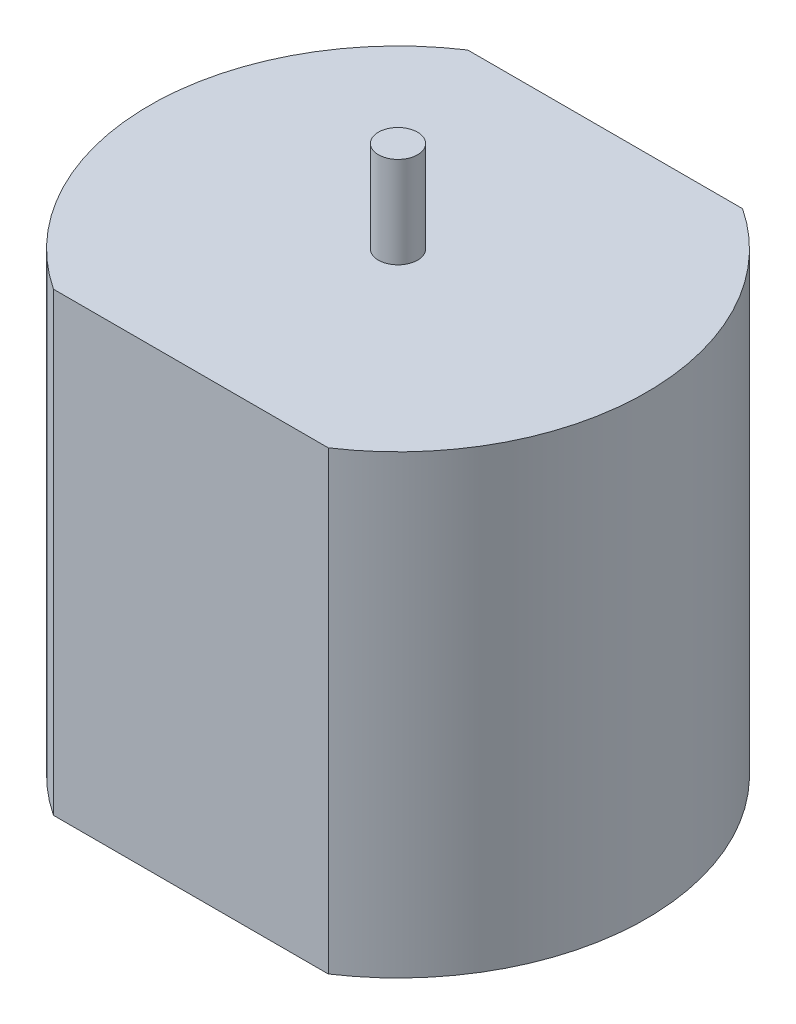
ISO-10303-21;
HEADER;
FILE_DESCRIPTION(('STEP AP214'),'2;1');
FILE_NAME('part.step','',(''),(''),'','','');
FILE_SCHEMA(('AUTOMOTIVE_DESIGN { 1 0 10303 214 1 1 1 1 }'));
ENDSEC;
DATA;
#1=APPLICATION_CONTEXT('core data for automotive mechanical design processes');
#2=APPLICATION_PROTOCOL_DEFINITION('international standard','automotive_design',2000,#1);
#3=PRODUCT_CONTEXT('',#1,'mechanical');
#4=PRODUCT('Part','Part','',(#3));
#5=PRODUCT_RELATED_PRODUCT_CATEGORY('part','',(#4));
#6=PRODUCT_DEFINITION_FORMATION('','',#4);
#7=PRODUCT_DEFINITION_CONTEXT('part definition',#1,'design');
#8=PRODUCT_DEFINITION('design','',#6,#7);
#9=PRODUCT_DEFINITION_SHAPE('','',#8);
#10=(LENGTH_UNIT() NAMED_UNIT(*) SI_UNIT(.MILLI.,.METRE.));
#11=(NAMED_UNIT(*) PLANE_ANGLE_UNIT() SI_UNIT($,.RADIAN.));
#12=(NAMED_UNIT(*) SI_UNIT($,.STERADIAN.) SOLID_ANGLE_UNIT());
#13=UNCERTAINTY_MEASURE_WITH_UNIT(LENGTH_MEASURE(1.E-05),#10,'distance_accuracy_value','');
#14=(GEOMETRIC_REPRESENTATION_CONTEXT(3) GLOBAL_UNCERTAINTY_ASSIGNED_CONTEXT((#13)) GLOBAL_UNIT_ASSIGNED_CONTEXT((#10,
#11,#12)) REPRESENTATION_CONTEXT('',''));
#15=CARTESIAN_POINT('',(0.,0.,0.));
#16=DIRECTION('',(0.,0.,1.));
#17=DIRECTION('',(1.,0.,0.));
#18=AXIS2_PLACEMENT_3D('',#15,#16,#17);
#19=CARTESIAN_POINT('',(0.,6.35,7.9375));
#20=DIRECTION('',(0.,0.,-1.));
#21=DIRECTION('',(-1.,0.,0.));
#22=AXIS2_PLACEMENT_3D('',#19,#20,#21);
#23=PLANE('',#22);
#24=DIRECTION('',(1.,0.,0.));
#25=VECTOR('',#24,1.);
#26=CARTESIAN_POINT('',(0.,0.,7.9375));
#27=LINE('',#26,#25);
#28=CARTESIAN_POINT('',(-5.2651418546892,0.,7.9375));
#29=VERTEX_POINT('',#28);
#30=CARTESIAN_POINT('',(5.2651418546892,0.,7.9375));
#31=VERTEX_POINT('',#30);
#32=EDGE_CURVE('E101',#29,#31,#27,.T.);
#33=ORIENTED_EDGE('',*,*,#32,.T.);
#34=DIRECTION('',(0.,-1.,0.));
#35=VECTOR('',#34,1.);
#36=CARTESIAN_POINT('',(5.2651418546892,6.35,7.9375));
#37=LINE('',#36,#35);
#38=CARTESIAN_POINT('',(5.2651418546892,17.4625,7.9375));
#39=VERTEX_POINT('',#38);
#40=EDGE_CURVE('E11',#39,#31,#37,.T.);
#41=ORIENTED_EDGE('',*,*,#40,.F.);
#42=DIRECTION('',(1.,0.,0.));
#43=VECTOR('',#42,1.);
#44=CARTESIAN_POINT('',(0.,17.4625,7.9375));
#45=LINE('',#44,#43);
#46=CARTESIAN_POINT('',(-5.2651418546892,17.4625,7.9375));
#47=VERTEX_POINT('',#46);
#48=EDGE_CURVE('E82',#47,#39,#45,.T.);
#49=ORIENTED_EDGE('',*,*,#48,.F.);
#50=DIRECTION('',(0.,-1.,0.));
#51=VECTOR('',#50,1.);
#52=CARTESIAN_POINT('',(-5.2651418546892,6.35,7.9375));
#53=LINE('',#52,#51);
#54=EDGE_CURVE('E72',#47,#29,#53,.T.);
#55=ORIENTED_EDGE('',*,*,#54,.T.);
#56=EDGE_LOOP('',(#33,#41,#49,#55));
#57=FACE_BOUND('',#56,.T.);
#58=ADVANCED_FACE('F37',(#57),#23,.F.);
#59=CARTESIAN_POINT('',(0.,6.35,0.));
#60=DIRECTION('',(0.,-1.,0.));
#61=DIRECTION('',(0.,0.,-1.));
#62=AXIS2_PLACEMENT_3D('',#59,#60,#61);
#63=CYLINDRICAL_SURFACE('',#62,9.525);
#64=CARTESIAN_POINT('',(0.,0.,0.));
#65=DIRECTION('',(0.,1.,0.));
#66=DIRECTION('',(0.,0.,1.));
#67=AXIS2_PLACEMENT_3D('',#64,#65,#66);
#68=CIRCLE('',#67,9.525);
#69=CARTESIAN_POINT('',(5.2651418546892,0.,-7.9375));
#70=VERTEX_POINT('',#69);
#71=EDGE_CURVE('E103',#31,#70,#68,.T.);
#72=ORIENTED_EDGE('',*,*,#71,.T.);
#73=DIRECTION('',(0.,-1.,0.));
#74=VECTOR('',#73,1.);
#75=CARTESIAN_POINT('',(5.2651418546892,6.35,-7.9375));
#76=LINE('',#75,#74);
#77=CARTESIAN_POINT('',(5.2651418546892,17.4625,-7.9375));
#78=VERTEX_POINT('',#77);
#79=EDGE_CURVE('E44',#78,#70,#76,.T.);
#80=ORIENTED_EDGE('',*,*,#79,.F.);
#81=CARTESIAN_POINT('',(0.,17.4625,0.));
#82=DIRECTION('',(0.,1.,0.));
#83=DIRECTION('',(0.,0.,1.));
#84=AXIS2_PLACEMENT_3D('',#81,#82,#83);
#85=CIRCLE('',#84,9.525);
#86=EDGE_CURVE('E86',#39,#78,#85,.T.);
#87=ORIENTED_EDGE('',*,*,#86,.F.);
#88=ORIENTED_EDGE('',*,*,#40,.T.);
#89=EDGE_LOOP('',(#72,#80,#87,#88));
#90=FACE_BOUND('',#89,.T.);
#91=ADVANCED_FACE('F114',(#90),#63,.T.);
#92=CARTESIAN_POINT('',(0.,6.35,-7.9375));
#93=DIRECTION('',(0.,0.,-1.));
#94=DIRECTION('',(-1.,0.,0.));
#95=AXIS2_PLACEMENT_3D('',#92,#93,#94);
#96=PLANE('',#95);
#97=DIRECTION('',(1.,0.,0.));
#98=VECTOR('',#97,1.);
#99=CARTESIAN_POINT('',(0.,0.,-7.9375));
#100=LINE('',#99,#98);
#101=CARTESIAN_POINT('',(-5.2651418546892,0.,-7.9375));
#102=VERTEX_POINT('',#101);
#103=EDGE_CURVE('E106',#102,#70,#100,.T.);
#104=ORIENTED_EDGE('',*,*,#103,.F.);
#105=DIRECTION('',(0.,-1.,0.));
#106=VECTOR('',#105,1.);
#107=CARTESIAN_POINT('',(-5.2651418546892,6.35,-7.9375));
#108=LINE('',#107,#106);
#109=CARTESIAN_POINT('',(-5.26514185468919,17.4625,-7.9375));
#110=VERTEX_POINT('',#109);
#111=EDGE_CURVE('E56',#110,#102,#108,.T.);
#112=ORIENTED_EDGE('',*,*,#111,.F.);
#113=DIRECTION('',(-1.,0.,0.));
#114=VECTOR('',#113,1.);
#115=CARTESIAN_POINT('',(0.,17.4625,-7.9375));
#116=LINE('',#115,#114);
#117=EDGE_CURVE('E91',#78,#110,#116,.T.);
#118=ORIENTED_EDGE('',*,*,#117,.F.);
#119=ORIENTED_EDGE('',*,*,#79,.T.);
#120=EDGE_LOOP('',(#104,#112,#118,#119));
#121=FACE_BOUND('',#120,.T.);
#122=ADVANCED_FACE('F112',(#121),#96,.T.);
#123=CARTESIAN_POINT('',(0.,6.35,0.));
#124=DIRECTION('',(0.,-1.,0.));
#125=DIRECTION('',(0.,0.,-1.));
#126=AXIS2_PLACEMENT_3D('',#123,#124,#125);
#127=CYLINDRICAL_SURFACE('',#126,9.525);
#128=CARTESIAN_POINT('',(0.,0.,0.));
#129=DIRECTION('',(0.,1.,0.));
#130=DIRECTION('',(0.,0.,1.));
#131=AXIS2_PLACEMENT_3D('',#128,#129,#130);
#132=CIRCLE('',#131,9.525);
#133=EDGE_CURVE('E51',#102,#29,#132,.T.);
#134=ORIENTED_EDGE('',*,*,#133,.T.);
#135=ORIENTED_EDGE('',*,*,#54,.F.);
#136=CARTESIAN_POINT('',(0.,17.4625,0.));
#137=DIRECTION('',(0.,1.,0.));
#138=DIRECTION('',(0.,0.,1.));
#139=AXIS2_PLACEMENT_3D('',#136,#137,#138);
#140=CIRCLE('',#139,9.525);
#141=EDGE_CURVE('E76',#110,#47,#140,.T.);
#142=ORIENTED_EDGE('',*,*,#141,.F.);
#143=ORIENTED_EDGE('',*,*,#111,.T.);
#144=EDGE_LOOP('',(#134,#135,#142,#143));
#145=FACE_BOUND('',#144,.T.);
#146=ADVANCED_FACE('F74',(#145),#127,.T.);
#147=CARTESIAN_POINT('',(0.,0.,0.));
#148=DIRECTION('',(0.,1.,0.));
#149=DIRECTION('',(0.,0.,1.));
#150=AXIS2_PLACEMENT_3D('',#147,#148,#149);
#151=PLANE('',#150);
#152=ORIENTED_EDGE('',*,*,#32,.F.);
#153=ORIENTED_EDGE('',*,*,#133,.F.);
#154=ORIENTED_EDGE('',*,*,#103,.T.);
#155=ORIENTED_EDGE('',*,*,#71,.F.);
#156=EDGE_LOOP('',(#152,#153,#154,#155));
#157=FACE_BOUND('',#156,.T.);
#158=ADVANCED_FACE('F116',(#157),#151,.F.);
#159=CARTESIAN_POINT('',(0.,17.4625,0.));
#160=DIRECTION('',(0.,1.,0.));
#161=DIRECTION('',(0.,0.,1.));
#162=AXIS2_PLACEMENT_3D('',#159,#160,#161);
#163=PLANE('',#162);
#164=CARTESIAN_POINT('',(0.,17.4625,0.));
#165=DIRECTION('',(0.,1.,0.));
#166=DIRECTION('',(0.,0.,1.));
#167=AXIS2_PLACEMENT_3D('',#164,#165,#166);
#168=CIRCLE('',#167,0.75);
#169=CARTESIAN_POINT('',(0.,17.4625,0.75));
#170=VERTEX_POINT('',#169);
#171=EDGE_CURVE('E95',#170,#170,#168,.T.);
#172=ORIENTED_EDGE('',*,*,#171,.F.);
#173=EDGE_LOOP('',(#172));
#174=FACE_BOUND('',#173,.T.);
#175=ORIENTED_EDGE('',*,*,#141,.T.);
#176=ORIENTED_EDGE('',*,*,#48,.T.);
#177=ORIENTED_EDGE('',*,*,#86,.T.);
#178=ORIENTED_EDGE('',*,*,#117,.T.);
#179=EDGE_LOOP('',(#175,#176,#177,#178));
#180=FACE_BOUND('',#179,.T.);
#181=ADVANCED_FACE('F89',(#174,#180),#163,.T.);
#182=CARTESIAN_POINT('',(0.,20.9625,0.));
#183=DIRECTION('',(0.,-1.,0.));
#184=DIRECTION('',(0.,0.,-1.));
#185=AXIS2_PLACEMENT_3D('',#182,#183,#184);
#186=CYLINDRICAL_SURFACE('',#185,0.75);
#187=CARTESIAN_POINT('',(0.,20.9625,0.));
#188=DIRECTION('',(0.,1.,0.));
#189=DIRECTION('',(0.,0.,1.));
#190=AXIS2_PLACEMENT_3D('',#187,#188,#189);
#191=CIRCLE('',#190,0.75);
#192=CARTESIAN_POINT('',(0.,20.9625,0.75));
#193=VERTEX_POINT('',#192);
#194=EDGE_CURVE('E92',#193,#193,#191,.T.);
#195=ORIENTED_EDGE('',*,*,#194,.F.);
#196=EDGE_LOOP('',(#195));
#197=FACE_BOUND('',#196,.T.);
#198=ORIENTED_EDGE('',*,*,#171,.T.);
#199=EDGE_LOOP('',(#198));
#200=FACE_BOUND('',#199,.T.);
#201=ADVANCED_FACE('F123',(#197,#200),#186,.T.);
#202=CARTESIAN_POINT('',(0.,20.9625,0.));
#203=DIRECTION('',(0.,1.,0.));
#204=DIRECTION('',(0.,0.,1.));
#205=AXIS2_PLACEMENT_3D('',#202,#203,#204);
#206=PLANE('',#205);
#207=ORIENTED_EDGE('',*,*,#194,.T.);
#208=EDGE_LOOP('',(#207));
#209=FACE_BOUND('',#208,.T.);
#210=ADVANCED_FACE('F159',(#209),#206,.T.);
#211=CLOSED_SHELL('',(#58,#91,#122,#146,#158,#181,#201,#210));
#212=MANIFOLD_SOLID_BREP('B2',#211);
#213=ADVANCED_BREP_SHAPE_REPRESENTATION('',(#18,#212),#14);
#214=SHAPE_DEFINITION_REPRESENTATION(#9,#213);
ENDSEC;
END-ISO-10303-21;
